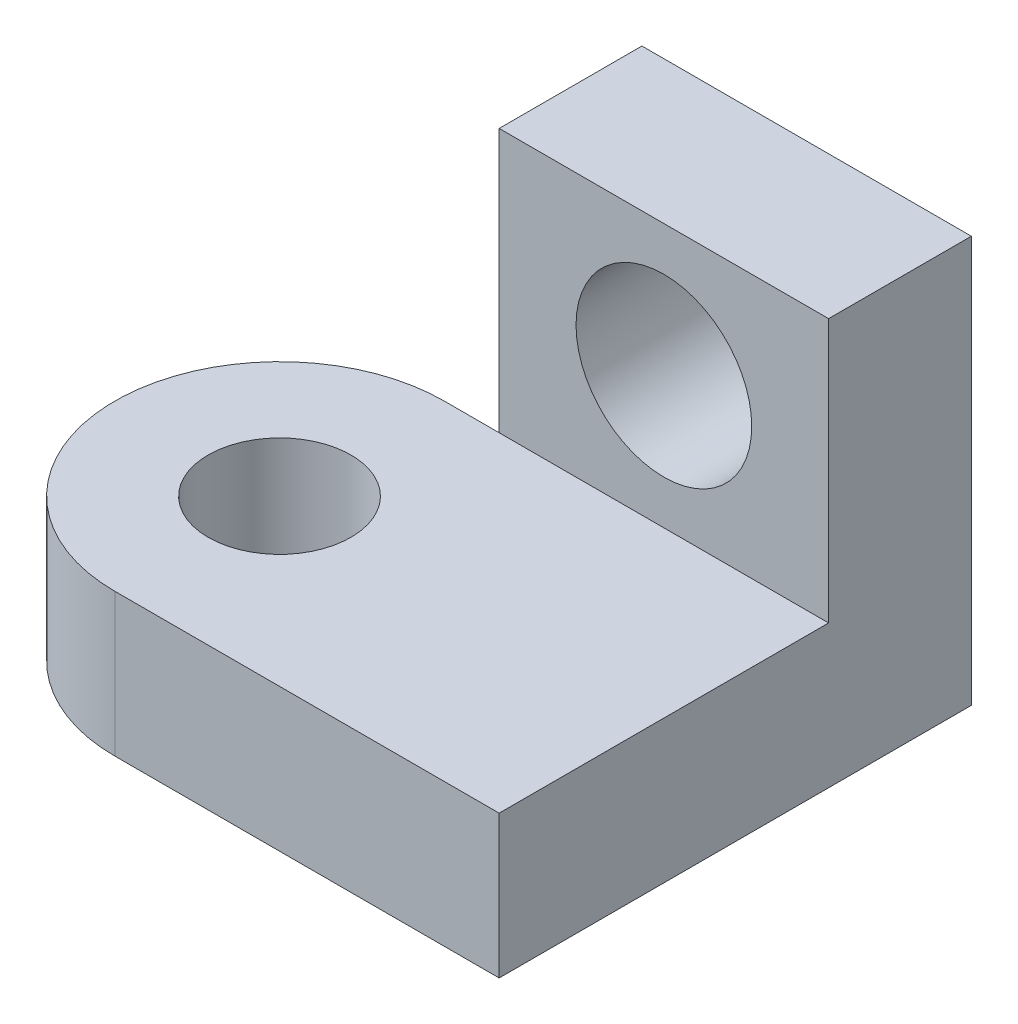
ISO-10303-21;
HEADER;
FILE_DESCRIPTION(('STEP AP214'),'2;1');
FILE_NAME('part.step','',(''),(''),'','','');
FILE_SCHEMA(('AUTOMOTIVE_DESIGN { 1 0 10303 214 1 1 1 1 }'));
ENDSEC;
DATA;
#1=APPLICATION_CONTEXT('core data for automotive mechanical design processes');
#2=APPLICATION_PROTOCOL_DEFINITION('international standard','automotive_design',2000,#1);
#3=PRODUCT_CONTEXT('',#1,'mechanical');
#4=PRODUCT('Part','Part','',(#3));
#5=PRODUCT_RELATED_PRODUCT_CATEGORY('part','',(#4));
#6=PRODUCT_DEFINITION_FORMATION('','',#4);
#7=PRODUCT_DEFINITION_CONTEXT('part definition',#1,'design');
#8=PRODUCT_DEFINITION('design','',#6,#7);
#9=PRODUCT_DEFINITION_SHAPE('','',#8);
#10=(LENGTH_UNIT() NAMED_UNIT(*) SI_UNIT(.MILLI.,.METRE.));
#11=(NAMED_UNIT(*) PLANE_ANGLE_UNIT() SI_UNIT($,.RADIAN.));
#12=(NAMED_UNIT(*) SI_UNIT($,.STERADIAN.) SOLID_ANGLE_UNIT());
#13=UNCERTAINTY_MEASURE_WITH_UNIT(LENGTH_MEASURE(1.E-05),#10,'distance_accuracy_value','');
#14=(GEOMETRIC_REPRESENTATION_CONTEXT(3) GLOBAL_UNCERTAINTY_ASSIGNED_CONTEXT((#13)) GLOBAL_UNIT_ASSIGNED_CONTEXT((#10,
#11,#12)) REPRESENTATION_CONTEXT('',''));
#15=CARTESIAN_POINT('',(0.,0.,0.));
#16=DIRECTION('',(0.,0.,1.));
#17=DIRECTION('',(1.,0.,0.));
#18=AXIS2_PLACEMENT_3D('',#15,#16,#17);
#19=CARTESIAN_POINT('',(0.,13.,-15.));
#20=DIRECTION('',(0.,-1.,0.));
#21=DIRECTION('',(0.,0.,-1.));
#22=AXIS2_PLACEMENT_3D('',#19,#20,#21);
#23=CYLINDRICAL_SURFACE('',#22,15.);
#24=CARTESIAN_POINT('',(0.,0.,-15.));
#25=DIRECTION('',(0.,1.,0.));
#26=DIRECTION('',(0.,0.,1.));
#27=AXIS2_PLACEMENT_3D('',#24,#25,#26);
#28=CIRCLE('',#27,15.);
#29=CARTESIAN_POINT('',(0.,0.,-30.));
#30=VERTEX_POINT('',#29);
#31=CARTESIAN_POINT('',(0.,0.,0.));
#32=VERTEX_POINT('',#31);
#33=EDGE_CURVE('E170',#30,#32,#28,.T.);
#34=ORIENTED_EDGE('',*,*,#33,.T.);
#35=DIRECTION('',(0.,-1.,0.));
#36=VECTOR('',#35,1.);
#37=CARTESIAN_POINT('',(0.,13.,0.));
#38=LINE('',#37,#36);
#39=CARTESIAN_POINT('',(0.,13.,0.));
#40=VERTEX_POINT('',#39);
#41=EDGE_CURVE('E11',#40,#32,#38,.T.);
#42=ORIENTED_EDGE('',*,*,#41,.F.);
#43=CARTESIAN_POINT('',(0.,13.,-15.));
#44=DIRECTION('',(0.,1.,0.));
#45=DIRECTION('',(0.,0.,1.));
#46=AXIS2_PLACEMENT_3D('',#43,#44,#45);
#47=CIRCLE('',#46,15.);
#48=CARTESIAN_POINT('',(0.,13.,-30.));
#49=VERTEX_POINT('',#48);
#50=EDGE_CURVE('E159',#49,#40,#47,.T.);
#51=ORIENTED_EDGE('',*,*,#50,.F.);
#52=DIRECTION('',(0.,-1.,0.));
#53=VECTOR('',#52,1.);
#54=CARTESIAN_POINT('',(0.,13.,-30.));
#55=LINE('',#54,#53);
#56=EDGE_CURVE('E61',#49,#30,#55,.T.);
#57=ORIENTED_EDGE('',*,*,#56,.T.);
#58=EDGE_LOOP('',(#34,#42,#51,#57));
#59=FACE_BOUND('',#58,.T.);
#60=ADVANCED_FACE('F43',(#59),#23,.T.);
#61=CARTESIAN_POINT('',(0.,13.,0.));
#62=DIRECTION('',(0.,0.,-1.));
#63=DIRECTION('',(-1.,0.,0.));
#64=AXIS2_PLACEMENT_3D('',#61,#62,#63);
#65=PLANE('',#64);
#66=DIRECTION('',(1.,0.,0.));
#67=VECTOR('',#66,1.);
#68=CARTESIAN_POINT('',(0.,0.,0.));
#69=LINE('',#68,#67);
#70=CARTESIAN_POINT('',(35.,0.,0.));
#71=VERTEX_POINT('',#70);
#72=EDGE_CURVE('E75',#32,#71,#69,.T.);
#73=ORIENTED_EDGE('',*,*,#72,.T.);
#74=DIRECTION('',(0.,-1.,0.));
#75=VECTOR('',#74,1.);
#76=CARTESIAN_POINT('',(35.,13.,0.));
#77=LINE('',#76,#75);
#78=CARTESIAN_POINT('',(35.,13.,0.));
#79=VERTEX_POINT('',#78);
#80=EDGE_CURVE('E53',#79,#71,#77,.T.);
#81=ORIENTED_EDGE('',*,*,#80,.F.);
#82=DIRECTION('',(1.,0.,0.));
#83=VECTOR('',#82,1.);
#84=CARTESIAN_POINT('',(0.,13.,0.));
#85=LINE('',#84,#83);
#86=EDGE_CURVE('E81',#40,#79,#85,.T.);
#87=ORIENTED_EDGE('',*,*,#86,.F.);
#88=ORIENTED_EDGE('',*,*,#41,.T.);
#89=EDGE_LOOP('',(#73,#81,#87,#88));
#90=FACE_BOUND('',#89,.T.);
#91=ADVANCED_FACE('F192',(#90),#65,.F.);
#92=CARTESIAN_POINT('',(35.,13.,0.));
#93=DIRECTION('',(-1.,0.,0.));
#94=DIRECTION('',(0.,0.,1.));
#95=AXIS2_PLACEMENT_3D('',#92,#93,#94);
#96=PLANE('',#95);
#97=DIRECTION('',(0.,0.,-1.));
#98=VECTOR('',#97,1.);
#99=CARTESIAN_POINT('',(35.,0.,0.));
#100=LINE('',#99,#98);
#101=CARTESIAN_POINT('',(35.,0.,-43.));
#102=VERTEX_POINT('',#101);
#103=EDGE_CURVE('E173',#71,#102,#100,.T.);
#104=ORIENTED_EDGE('',*,*,#103,.T.);
#105=DIRECTION('',(0.,-1.,0.));
#106=VECTOR('',#105,1.);
#107=CARTESIAN_POINT('',(35.,37.,-43.));
#108=LINE('',#107,#106);
#109=CARTESIAN_POINT('',(35.,37.,-43.));
#110=VERTEX_POINT('',#109);
#111=EDGE_CURVE('E150',#110,#102,#108,.T.);
#112=ORIENTED_EDGE('',*,*,#111,.F.);
#113=DIRECTION('',(0.,0.,-1.));
#114=VECTOR('',#113,1.);
#115=CARTESIAN_POINT('',(35.,37.,0.));
#116=LINE('',#115,#114);
#117=CARTESIAN_POINT('',(35.,37.,-30.));
#118=VERTEX_POINT('',#117);
#119=EDGE_CURVE('E130',#118,#110,#116,.T.);
#120=ORIENTED_EDGE('',*,*,#119,.F.);
#121=DIRECTION('',(0.,-1.,0.));
#122=VECTOR('',#121,1.);
#123=CARTESIAN_POINT('',(35.,37.,-30.));
#124=LINE('',#123,#122);
#125=CARTESIAN_POINT('',(35.,13.,-30.));
#126=VERTEX_POINT('',#125);
#127=EDGE_CURVE('E127',#118,#126,#124,.T.);
#128=ORIENTED_EDGE('',*,*,#127,.T.);
#129=DIRECTION('',(0.,0.,-1.));
#130=VECTOR('',#129,1.);
#131=CARTESIAN_POINT('',(35.,13.,0.));
#132=LINE('',#131,#130);
#133=EDGE_CURVE('E163',#79,#126,#132,.T.);
#134=ORIENTED_EDGE('',*,*,#133,.F.);
#135=ORIENTED_EDGE('',*,*,#80,.T.);
#136=EDGE_LOOP('',(#104,#112,#120,#128,#134,#135));
#137=FACE_BOUND('',#136,.T.);
#138=ADVANCED_FACE('F181',(#137),#96,.F.);
#139=CARTESIAN_POINT('',(0.,13.,-15.));
#140=DIRECTION('',(0.,-1.,0.));
#141=DIRECTION('',(0.,0.,-1.));
#142=AXIS2_PLACEMENT_3D('',#139,#140,#141);
#143=CYLINDRICAL_SURFACE('',#142,6.5);
#144=CARTESIAN_POINT('',(0.,13.,-15.));
#145=DIRECTION('',(0.,1.,0.));
#146=DIRECTION('',(0.,0.,1.));
#147=AXIS2_PLACEMENT_3D('',#144,#145,#146);
#148=CIRCLE('',#147,6.5);
#149=CARTESIAN_POINT('',(0.,13.,-8.5));
#150=VERTEX_POINT('',#149);
#151=EDGE_CURVE('E156',#150,#150,#148,.T.);
#152=ORIENTED_EDGE('',*,*,#151,.T.);
#153=EDGE_LOOP('',(#152));
#154=FACE_BOUND('',#153,.T.);
#155=CARTESIAN_POINT('',(0.,0.,-15.));
#156=DIRECTION('',(0.,1.,0.));
#157=DIRECTION('',(0.,0.,1.));
#158=AXIS2_PLACEMENT_3D('',#155,#156,#157);
#159=CIRCLE('',#158,6.5);
#160=CARTESIAN_POINT('',(0.,0.,-8.5));
#161=VERTEX_POINT('',#160);
#162=EDGE_CURVE('E155',#161,#161,#159,.T.);
#163=ORIENTED_EDGE('',*,*,#162,.F.);
#164=EDGE_LOOP('',(#163));
#165=FACE_BOUND('',#164,.T.);
#166=ADVANCED_FACE('F45',(#154,#165),#143,.F.);
#167=CARTESIAN_POINT('',(0.,13.,-30.));
#168=DIRECTION('',(0.,0.,-1.));
#169=DIRECTION('',(-1.,0.,0.));
#170=AXIS2_PLACEMENT_3D('',#167,#168,#169);
#171=PLANE('',#170);
#172=DIRECTION('',(0.,-1.,0.));
#173=VECTOR('',#172,1.);
#174=CARTESIAN_POINT('',(5.,37.,-30.));
#175=LINE('',#174,#173);
#176=CARTESIAN_POINT('',(5.,13.,-30.));
#177=VERTEX_POINT('',#176);
#178=CARTESIAN_POINT('',(5.,0.,-30.));
#179=VERTEX_POINT('',#178);
#180=EDGE_CURVE('E118',#177,#179,#175,.T.);
#181=ORIENTED_EDGE('',*,*,#180,.T.);
#182=DIRECTION('',(1.,0.,0.));
#183=VECTOR('',#182,1.);
#184=CARTESIAN_POINT('',(0.,0.,-30.));
#185=LINE('',#184,#183);
#186=EDGE_CURVE('E160',#30,#179,#185,.T.);
#187=ORIENTED_EDGE('',*,*,#186,.F.);
#188=ORIENTED_EDGE('',*,*,#56,.F.);
#189=DIRECTION('',(1.,0.,0.));
#190=VECTOR('',#189,1.);
#191=CARTESIAN_POINT('',(0.,13.,-30.));
#192=LINE('',#191,#190);
#193=EDGE_CURVE('E166',#49,#177,#192,.T.);
#194=ORIENTED_EDGE('',*,*,#193,.T.);
#195=EDGE_LOOP('',(#181,#187,#188,#194));
#196=FACE_BOUND('',#195,.T.);
#197=ADVANCED_FACE('F201',(#196),#171,.T.);
#198=CARTESIAN_POINT('',(0.,13.,0.));
#199=DIRECTION('',(0.,1.,0.));
#200=DIRECTION('',(0.,0.,1.));
#201=AXIS2_PLACEMENT_3D('',#198,#199,#200);
#202=PLANE('',#201);
#203=ORIENTED_EDGE('',*,*,#151,.F.);
#204=EDGE_LOOP('',(#203));
#205=FACE_BOUND('',#204,.T.);
#206=ORIENTED_EDGE('',*,*,#50,.T.);
#207=ORIENTED_EDGE('',*,*,#86,.T.);
#208=ORIENTED_EDGE('',*,*,#133,.T.);
#209=DIRECTION('',(-1.,0.,0.));
#210=VECTOR('',#209,1.);
#211=CARTESIAN_POINT('',(0.,13.,-30.));
#212=LINE('',#211,#210);
#213=EDGE_CURVE('E121',#126,#177,#212,.T.);
#214=ORIENTED_EDGE('',*,*,#213,.T.);
#215=ORIENTED_EDGE('',*,*,#193,.F.);
#216=EDGE_LOOP('',(#206,#207,#208,#214,#215));
#217=FACE_BOUND('',#216,.T.);
#218=ADVANCED_FACE('F189',(#205,#217),#202,.T.);
#219=CARTESIAN_POINT('',(0.,0.,0.));
#220=DIRECTION('',(0.,1.,0.));
#221=DIRECTION('',(0.,0.,1.));
#222=AXIS2_PLACEMENT_3D('',#219,#220,#221);
#223=PLANE('',#222);
#224=ORIENTED_EDGE('',*,*,#162,.T.);
#225=EDGE_LOOP('',(#224));
#226=FACE_BOUND('',#225,.T.);
#227=ORIENTED_EDGE('',*,*,#33,.F.);
#228=ORIENTED_EDGE('',*,*,#186,.T.);
#229=DIRECTION('',(0.,0.,-1.));
#230=VECTOR('',#229,1.);
#231=CARTESIAN_POINT('',(5.,0.,0.));
#232=LINE('',#231,#230);
#233=CARTESIAN_POINT('',(5.,0.,-43.));
#234=VERTEX_POINT('',#233);
#235=EDGE_CURVE('E139',#179,#234,#232,.T.);
#236=ORIENTED_EDGE('',*,*,#235,.T.);
#237=DIRECTION('',(-1.,0.,0.));
#238=VECTOR('',#237,1.);
#239=CARTESIAN_POINT('',(0.,0.,-43.));
#240=LINE('',#239,#238);
#241=EDGE_CURVE('E136',#102,#234,#240,.T.);
#242=ORIENTED_EDGE('',*,*,#241,.F.);
#243=ORIENTED_EDGE('',*,*,#103,.F.);
#244=ORIENTED_EDGE('',*,*,#72,.F.);
#245=EDGE_LOOP('',(#227,#228,#236,#242,#243,#244));
#246=FACE_BOUND('',#245,.T.);
#247=ADVANCED_FACE('F185',(#226,#246),#223,.F.);
#248=CARTESIAN_POINT('',(5.,37.,0.));
#249=DIRECTION('',(-1.,0.,0.));
#250=DIRECTION('',(0.,0.,1.));
#251=AXIS2_PLACEMENT_3D('',#248,#249,#250);
#252=PLANE('',#251);
#253=ORIENTED_EDGE('',*,*,#235,.F.);
#254=ORIENTED_EDGE('',*,*,#180,.F.);
#255=CARTESIAN_POINT('',(5.,37.,-30.));
#256=VERTEX_POINT('',#255);
#257=EDGE_CURVE('E112',#256,#177,#175,.T.);
#258=ORIENTED_EDGE('',*,*,#257,.F.);
#259=DIRECTION('',(0.,0.,-1.));
#260=VECTOR('',#259,1.);
#261=CARTESIAN_POINT('',(5.,37.,0.));
#262=LINE('',#261,#260);
#263=CARTESIAN_POINT('',(5.,37.,-43.));
#264=VERTEX_POINT('',#263);
#265=EDGE_CURVE('E116',#256,#264,#262,.T.);
#266=ORIENTED_EDGE('',*,*,#265,.T.);
#267=DIRECTION('',(0.,-1.,0.));
#268=VECTOR('',#267,1.);
#269=CARTESIAN_POINT('',(5.,37.,-43.));
#270=LINE('',#269,#268);
#271=EDGE_CURVE('E146',#264,#234,#270,.T.);
#272=ORIENTED_EDGE('',*,*,#271,.T.);
#273=EDGE_LOOP('',(#253,#254,#258,#266,#272));
#274=FACE_BOUND('',#273,.T.);
#275=ADVANCED_FACE('F114',(#274),#252,.T.);
#276=CARTESIAN_POINT('',(0.,37.,-30.));
#277=DIRECTION('',(0.,0.,-1.));
#278=DIRECTION('',(-1.,0.,0.));
#279=AXIS2_PLACEMENT_3D('',#276,#277,#278);
#280=PLANE('',#279);
#281=CARTESIAN_POINT('',(20.,25.,-30.));
#282=DIRECTION('',(0.,0.,1.));
#283=DIRECTION('',(1.,0.,0.));
#284=AXIS2_PLACEMENT_3D('',#281,#282,#283);
#285=CIRCLE('',#284,8.);
#286=CARTESIAN_POINT('',(28.,25.,-30.));
#287=VERTEX_POINT('',#286);
#288=EDGE_CURVE('E142',#287,#287,#285,.T.);
#289=ORIENTED_EDGE('',*,*,#288,.F.);
#290=EDGE_LOOP('',(#289));
#291=FACE_BOUND('',#290,.T.);
#292=ORIENTED_EDGE('',*,*,#213,.F.);
#293=ORIENTED_EDGE('',*,*,#127,.F.);
#294=DIRECTION('',(1.,0.,0.));
#295=VECTOR('',#294,1.);
#296=CARTESIAN_POINT('',(0.,37.,-30.));
#297=LINE('',#296,#295);
#298=EDGE_CURVE('E124',#256,#118,#297,.T.);
#299=ORIENTED_EDGE('',*,*,#298,.F.);
#300=ORIENTED_EDGE('',*,*,#257,.T.);
#301=EDGE_LOOP('',(#292,#293,#299,#300));
#302=FACE_BOUND('',#301,.T.);
#303=ADVANCED_FACE('F125',(#291,#302),#280,.F.);
#304=CARTESIAN_POINT('',(0.,37.,-43.));
#305=DIRECTION('',(0.,0.,1.));
#306=DIRECTION('',(1.,0.,0.));
#307=AXIS2_PLACEMENT_3D('',#304,#305,#306);
#308=PLANE('',#307);
#309=CARTESIAN_POINT('',(20.,25.,-43.));
#310=DIRECTION('',(0.,0.,1.));
#311=DIRECTION('',(1.,0.,0.));
#312=AXIS2_PLACEMENT_3D('',#309,#310,#311);
#313=CIRCLE('',#312,8.);
#314=CARTESIAN_POINT('',(28.,25.,-43.));
#315=VERTEX_POINT('',#314);
#316=EDGE_CURVE('E47',#315,#315,#313,.T.);
#317=ORIENTED_EDGE('',*,*,#316,.T.);
#318=EDGE_LOOP('',(#317));
#319=FACE_BOUND('',#318,.T.);
#320=ORIENTED_EDGE('',*,*,#241,.T.);
#321=ORIENTED_EDGE('',*,*,#271,.F.);
#322=DIRECTION('',(-1.,0.,0.));
#323=VECTOR('',#322,1.);
#324=CARTESIAN_POINT('',(0.,37.,-43.));
#325=LINE('',#324,#323);
#326=EDGE_CURVE('E134',#110,#264,#325,.T.);
#327=ORIENTED_EDGE('',*,*,#326,.F.);
#328=ORIENTED_EDGE('',*,*,#111,.T.);
#329=EDGE_LOOP('',(#320,#321,#327,#328));
#330=FACE_BOUND('',#329,.T.);
#331=ADVANCED_FACE('F187',(#319,#330),#308,.F.);
#332=CARTESIAN_POINT('',(0.,37.,0.));
#333=DIRECTION('',(0.,1.,0.));
#334=DIRECTION('',(0.,0.,1.));
#335=AXIS2_PLACEMENT_3D('',#332,#333,#334);
#336=PLANE('',#335);
#337=ORIENTED_EDGE('',*,*,#265,.F.);
#338=ORIENTED_EDGE('',*,*,#298,.T.);
#339=ORIENTED_EDGE('',*,*,#119,.T.);
#340=ORIENTED_EDGE('',*,*,#326,.T.);
#341=EDGE_LOOP('',(#337,#338,#339,#340));
#342=FACE_BOUND('',#341,.T.);
#343=ADVANCED_FACE('F132',(#342),#336,.T.);
#344=CARTESIAN_POINT('',(20.,25.,-67.));
#345=DIRECTION('',(0.,0.,1.));
#346=DIRECTION('',(1.,0.,0.));
#347=AXIS2_PLACEMENT_3D('',#344,#345,#346);
#348=CYLINDRICAL_SURFACE('',#347,8.);
#349=ORIENTED_EDGE('',*,*,#288,.T.);
#350=EDGE_LOOP('',(#349));
#351=FACE_BOUND('',#350,.T.);
#352=ORIENTED_EDGE('',*,*,#316,.F.);
#353=EDGE_LOOP('',(#352));
#354=FACE_BOUND('',#353,.T.);
#355=ADVANCED_FACE('F220',(#351,#354),#348,.F.);
#356=CLOSED_SHELL('',(#60,#91,#138,#166,#197,#218,#247,#275,#303,#331,#343,#355));
#357=MANIFOLD_SOLID_BREP('B2',#356);
#358=ADVANCED_BREP_SHAPE_REPRESENTATION('',(#18,#357),#14);
#359=SHAPE_DEFINITION_REPRESENTATION(#9,#358);
ENDSEC;
END-ISO-10303-21;
